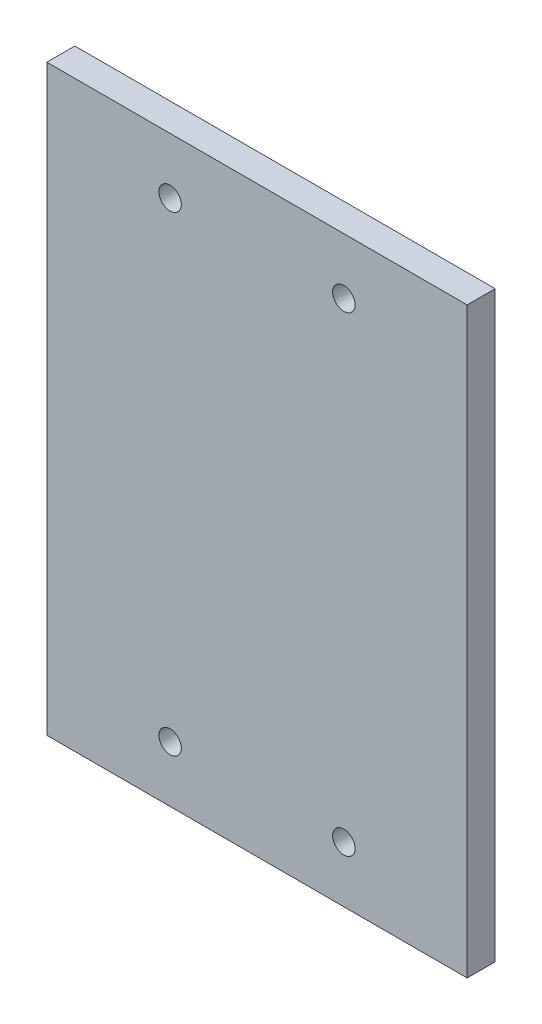
ISO-10303-21;
HEADER;
FILE_DESCRIPTION(('STEP AP214'),'2;1');
FILE_NAME('part.step','',(''),(''),'','','');
FILE_SCHEMA(('AUTOMOTIVE_DESIGN { 1 0 10303 214 1 1 1 1 }'));
ENDSEC;
DATA;
#1=APPLICATION_CONTEXT('core data for automotive mechanical design processes');
#2=APPLICATION_PROTOCOL_DEFINITION('international standard','automotive_design',2000,#1);
#3=PRODUCT_CONTEXT('',#1,'mechanical');
#4=PRODUCT('Part','Part','',(#3));
#5=PRODUCT_RELATED_PRODUCT_CATEGORY('part','',(#4));
#6=PRODUCT_DEFINITION_FORMATION('','',#4);
#7=PRODUCT_DEFINITION_CONTEXT('part definition',#1,'design');
#8=PRODUCT_DEFINITION('design','',#6,#7);
#9=PRODUCT_DEFINITION_SHAPE('','',#8);
#10=(LENGTH_UNIT() NAMED_UNIT(*) SI_UNIT(.MILLI.,.METRE.));
#11=(NAMED_UNIT(*) PLANE_ANGLE_UNIT() SI_UNIT($,.RADIAN.));
#12=(NAMED_UNIT(*) SI_UNIT($,.STERADIAN.) SOLID_ANGLE_UNIT());
#13=UNCERTAINTY_MEASURE_WITH_UNIT(LENGTH_MEASURE(1.E-05),#10,'distance_accuracy_value','');
#14=(GEOMETRIC_REPRESENTATION_CONTEXT(3) GLOBAL_UNCERTAINTY_ASSIGNED_CONTEXT((#13)) GLOBAL_UNIT_ASSIGNED_CONTEXT((#10,
#11,#12)) REPRESENTATION_CONTEXT('',''));
#15=CARTESIAN_POINT('',(0.,0.,0.));
#16=DIRECTION('',(0.,0.,1.));
#17=DIRECTION('',(1.,0.,0.));
#18=AXIS2_PLACEMENT_3D('',#15,#16,#17);
#19=CARTESIAN_POINT('',(0.,0.,5.));
#20=DIRECTION('',(0.,0.,1.));
#21=DIRECTION('',(1.,0.,0.));
#22=AXIS2_PLACEMENT_3D('',#19,#20,#21);
#23=PLANE('',#22);
#24=CARTESIAN_POINT('',(15.5,42.,5.));
#25=DIRECTION('',(0.,0.,1.));
#26=DIRECTION('',(1.,0.,0.));
#27=AXIS2_PLACEMENT_3D('',#24,#25,#26);
#28=CIRCLE('',#27,2.);
#29=CARTESIAN_POINT('',(17.5,42.,5.));
#30=VERTEX_POINT('',#29);
#31=EDGE_CURVE('E121',#30,#30,#28,.T.);
#32=ORIENTED_EDGE('',*,*,#31,.F.);
#33=EDGE_LOOP('',(#32));
#34=FACE_BOUND('',#33,.T.);
#35=CARTESIAN_POINT('',(15.5,-42.,5.));
#36=DIRECTION('',(0.,0.,1.));
#37=DIRECTION('',(1.,0.,0.));
#38=AXIS2_PLACEMENT_3D('',#35,#36,#37);
#39=CIRCLE('',#38,2.);
#40=CARTESIAN_POINT('',(17.5,-42.,5.));
#41=VERTEX_POINT('',#40);
#42=EDGE_CURVE('E100',#41,#41,#39,.T.);
#43=ORIENTED_EDGE('',*,*,#42,.F.);
#44=EDGE_LOOP('',(#43));
#45=FACE_BOUND('',#44,.T.);
#46=DIRECTION('',(1.,0.,0.));
#47=VECTOR('',#46,1.);
#48=CARTESIAN_POINT('',(-37.5,-52.,5.));
#49=LINE('',#48,#47);
#50=CARTESIAN_POINT('',(-37.5,-52.,5.));
#51=VERTEX_POINT('',#50);
#52=CARTESIAN_POINT('',(37.5,-52.,5.));
#53=VERTEX_POINT('',#52);
#54=EDGE_CURVE('E85',#51,#53,#49,.T.);
#55=ORIENTED_EDGE('',*,*,#54,.T.);
#56=DIRECTION('',(0.,1.,0.));
#57=VECTOR('',#56,1.);
#58=CARTESIAN_POINT('',(37.5,-52.,5.));
#59=LINE('',#58,#57);
#60=CARTESIAN_POINT('',(37.5,52.,5.));
#61=VERTEX_POINT('',#60);
#62=EDGE_CURVE('E80',#53,#61,#59,.T.);
#63=ORIENTED_EDGE('',*,*,#62,.T.);
#64=DIRECTION('',(-1.,0.,0.));
#65=VECTOR('',#64,1.);
#66=CARTESIAN_POINT('',(37.5,52.,5.));
#67=LINE('',#66,#65);
#68=CARTESIAN_POINT('',(-37.5,52.,5.));
#69=VERTEX_POINT('',#68);
#70=EDGE_CURVE('E83',#61,#69,#67,.T.);
#71=ORIENTED_EDGE('',*,*,#70,.T.);
#72=DIRECTION('',(0.,-1.,0.));
#73=VECTOR('',#72,1.);
#74=CARTESIAN_POINT('',(-37.5,52.,5.));
#75=LINE('',#74,#73);
#76=EDGE_CURVE('E50',#69,#51,#75,.T.);
#77=ORIENTED_EDGE('',*,*,#76,.T.);
#78=EDGE_LOOP('',(#55,#63,#71,#77));
#79=FACE_BOUND('',#78,.T.);
#80=CARTESIAN_POINT('',(-15.5,-42.,5.));
#81=DIRECTION('',(0.,0.,1.));
#82=DIRECTION('',(1.,0.,0.));
#83=AXIS2_PLACEMENT_3D('',#80,#81,#82);
#84=CIRCLE('',#83,2.);
#85=CARTESIAN_POINT('',(-13.5,-42.,5.));
#86=VERTEX_POINT('',#85);
#87=EDGE_CURVE('E115',#86,#86,#84,.T.);
#88=ORIENTED_EDGE('',*,*,#87,.F.);
#89=EDGE_LOOP('',(#88));
#90=FACE_BOUND('',#89,.T.);
#91=CARTESIAN_POINT('',(-15.5,42.,5.));
#92=DIRECTION('',(0.,0.,1.));
#93=DIRECTION('',(1.,0.,0.));
#94=AXIS2_PLACEMENT_3D('',#91,#92,#93);
#95=CIRCLE('',#94,2.);
#96=CARTESIAN_POINT('',(-13.5,42.,5.));
#97=VERTEX_POINT('',#96);
#98=EDGE_CURVE('E127',#97,#97,#95,.T.);
#99=ORIENTED_EDGE('',*,*,#98,.F.);
#100=EDGE_LOOP('',(#99));
#101=FACE_BOUND('',#100,.T.);
#102=ADVANCED_FACE('F33',(#34,#45,#79,#90,#101),#23,.T.);
#103=CARTESIAN_POINT('',(0.,0.,0.));
#104=DIRECTION('',(0.,0.,1.));
#105=DIRECTION('',(1.,0.,0.));
#106=AXIS2_PLACEMENT_3D('',#103,#104,#105);
#107=PLANE('',#106);
#108=DIRECTION('',(1.,0.,0.));
#109=VECTOR('',#108,1.);
#110=CARTESIAN_POINT('',(-37.5,-52.,0.));
#111=LINE('',#110,#109);
#112=CARTESIAN_POINT('',(-37.5,-52.,0.));
#113=VERTEX_POINT('',#112);
#114=CARTESIAN_POINT('',(37.5,-52.,0.));
#115=VERTEX_POINT('',#114);
#116=EDGE_CURVE('E97',#113,#115,#111,.T.);
#117=ORIENTED_EDGE('',*,*,#116,.F.);
#118=DIRECTION('',(0.,-1.,0.));
#119=VECTOR('',#118,1.);
#120=CARTESIAN_POINT('',(-37.5,52.,0.));
#121=LINE('',#120,#119);
#122=CARTESIAN_POINT('',(-37.5,52.,0.));
#123=VERTEX_POINT('',#122);
#124=EDGE_CURVE('E73',#123,#113,#121,.T.);
#125=ORIENTED_EDGE('',*,*,#124,.F.);
#126=DIRECTION('',(-1.,0.,0.));
#127=VECTOR('',#126,1.);
#128=CARTESIAN_POINT('',(37.5,52.,0.));
#129=LINE('',#128,#127);
#130=CARTESIAN_POINT('',(37.5,52.,0.));
#131=VERTEX_POINT('',#130);
#132=EDGE_CURVE('E67',#131,#123,#129,.T.);
#133=ORIENTED_EDGE('',*,*,#132,.F.);
#134=DIRECTION('',(0.,1.,0.));
#135=VECTOR('',#134,1.);
#136=CARTESIAN_POINT('',(37.5,-52.,0.));
#137=LINE('',#136,#135);
#138=EDGE_CURVE('E89',#115,#131,#137,.T.);
#139=ORIENTED_EDGE('',*,*,#138,.F.);
#140=EDGE_LOOP('',(#117,#125,#133,#139));
#141=FACE_BOUND('',#140,.T.);
#142=CARTESIAN_POINT('',(15.5,-42.,0.));
#143=DIRECTION('',(0.,0.,1.));
#144=DIRECTION('',(1.,0.,0.));
#145=AXIS2_PLACEMENT_3D('',#142,#143,#144);
#146=CIRCLE('',#145,2.);
#147=CARTESIAN_POINT('',(17.5,-42.,0.));
#148=VERTEX_POINT('',#147);
#149=EDGE_CURVE('E112',#148,#148,#146,.T.);
#150=ORIENTED_EDGE('',*,*,#149,.T.);
#151=EDGE_LOOP('',(#150));
#152=FACE_BOUND('',#151,.T.);
#153=CARTESIAN_POINT('',(-15.5,-42.,0.));
#154=DIRECTION('',(0.,0.,1.));
#155=DIRECTION('',(1.,0.,0.));
#156=AXIS2_PLACEMENT_3D('',#153,#154,#155);
#157=CIRCLE('',#156,2.);
#158=CARTESIAN_POINT('',(-13.5,-42.,0.));
#159=VERTEX_POINT('',#158);
#160=EDGE_CURVE('E118',#159,#159,#157,.T.);
#161=ORIENTED_EDGE('',*,*,#160,.T.);
#162=EDGE_LOOP('',(#161));
#163=FACE_BOUND('',#162,.T.);
#164=CARTESIAN_POINT('',(15.5,42.,0.));
#165=DIRECTION('',(0.,0.,1.));
#166=DIRECTION('',(1.,0.,0.));
#167=AXIS2_PLACEMENT_3D('',#164,#165,#166);
#168=CIRCLE('',#167,2.);
#169=CARTESIAN_POINT('',(17.5,42.,0.));
#170=VERTEX_POINT('',#169);
#171=EDGE_CURVE('E124',#170,#170,#168,.T.);
#172=ORIENTED_EDGE('',*,*,#171,.T.);
#173=EDGE_LOOP('',(#172));
#174=FACE_BOUND('',#173,.T.);
#175=CARTESIAN_POINT('',(-15.5,42.,0.));
#176=DIRECTION('',(0.,0.,1.));
#177=DIRECTION('',(1.,0.,0.));
#178=AXIS2_PLACEMENT_3D('',#175,#176,#177);
#179=CIRCLE('',#178,2.);
#180=CARTESIAN_POINT('',(-13.5,42.,0.));
#181=VERTEX_POINT('',#180);
#182=EDGE_CURVE('E130',#181,#181,#179,.T.);
#183=ORIENTED_EDGE('',*,*,#182,.T.);
#184=EDGE_LOOP('',(#183));
#185=FACE_BOUND('',#184,.T.);
#186=ADVANCED_FACE('F108',(#141,#152,#163,#174,#185),#107,.F.);
#187=CARTESIAN_POINT('',(-37.5,-52.,5.));
#188=DIRECTION('',(0.,1.,0.));
#189=DIRECTION('',(0.,0.,1.));
#190=AXIS2_PLACEMENT_3D('',#187,#188,#189);
#191=PLANE('',#190);
#192=ORIENTED_EDGE('',*,*,#116,.T.);
#193=DIRECTION('',(0.,0.,-1.));
#194=VECTOR('',#193,1.);
#195=CARTESIAN_POINT('',(37.5,-52.,5.));
#196=LINE('',#195,#194);
#197=EDGE_CURVE('E11',#53,#115,#196,.T.);
#198=ORIENTED_EDGE('',*,*,#197,.F.);
#199=ORIENTED_EDGE('',*,*,#54,.F.);
#200=DIRECTION('',(0.,0.,-1.));
#201=VECTOR('',#200,1.);
#202=CARTESIAN_POINT('',(-37.5,-52.,5.));
#203=LINE('',#202,#201);
#204=EDGE_CURVE('E93',#51,#113,#203,.T.);
#205=ORIENTED_EDGE('',*,*,#204,.T.);
#206=EDGE_LOOP('',(#192,#198,#199,#205));
#207=FACE_BOUND('',#206,.T.);
#208=ADVANCED_FACE('F35',(#207),#191,.F.);
#209=CARTESIAN_POINT('',(37.5,-52.,5.));
#210=DIRECTION('',(-1.,0.,0.));
#211=DIRECTION('',(0.,0.,1.));
#212=AXIS2_PLACEMENT_3D('',#209,#210,#211);
#213=PLANE('',#212);
#214=ORIENTED_EDGE('',*,*,#138,.T.);
#215=DIRECTION('',(0.,0.,-1.));
#216=VECTOR('',#215,1.);
#217=CARTESIAN_POINT('',(37.5,52.,5.));
#218=LINE('',#217,#216);
#219=EDGE_CURVE('E42',#61,#131,#218,.T.);
#220=ORIENTED_EDGE('',*,*,#219,.F.);
#221=ORIENTED_EDGE('',*,*,#62,.F.);
#222=ORIENTED_EDGE('',*,*,#197,.T.);
#223=EDGE_LOOP('',(#214,#220,#221,#222));
#224=FACE_BOUND('',#223,.T.);
#225=ADVANCED_FACE('F88',(#224),#213,.F.);
#226=CARTESIAN_POINT('',(37.5,52.,5.));
#227=DIRECTION('',(0.,-1.,0.));
#228=DIRECTION('',(0.,0.,-1.));
#229=AXIS2_PLACEMENT_3D('',#226,#227,#228);
#230=PLANE('',#229);
#231=ORIENTED_EDGE('',*,*,#132,.T.);
#232=DIRECTION('',(0.,0.,-1.));
#233=VECTOR('',#232,1.);
#234=CARTESIAN_POINT('',(-37.5,52.,5.));
#235=LINE('',#234,#233);
#236=EDGE_CURVE('E90',#69,#123,#235,.T.);
#237=ORIENTED_EDGE('',*,*,#236,.F.);
#238=ORIENTED_EDGE('',*,*,#70,.F.);
#239=ORIENTED_EDGE('',*,*,#219,.T.);
#240=EDGE_LOOP('',(#231,#237,#238,#239));
#241=FACE_BOUND('',#240,.T.);
#242=ADVANCED_FACE('F91',(#241),#230,.F.);
#243=CARTESIAN_POINT('',(-37.5,52.,5.));
#244=DIRECTION('',(1.,0.,0.));
#245=DIRECTION('',(0.,0.,-1.));
#246=AXIS2_PLACEMENT_3D('',#243,#244,#245);
#247=PLANE('',#246);
#248=ORIENTED_EDGE('',*,*,#124,.T.);
#249=ORIENTED_EDGE('',*,*,#204,.F.);
#250=ORIENTED_EDGE('',*,*,#76,.F.);
#251=ORIENTED_EDGE('',*,*,#236,.T.);
#252=EDGE_LOOP('',(#248,#249,#250,#251));
#253=FACE_BOUND('',#252,.T.);
#254=ADVANCED_FACE('F105',(#253),#247,.F.);
#255=CARTESIAN_POINT('',(15.5,-42.,5.));
#256=DIRECTION('',(0.,0.,-1.));
#257=DIRECTION('',(-1.,0.,0.));
#258=AXIS2_PLACEMENT_3D('',#255,#256,#257);
#259=CYLINDRICAL_SURFACE('',#258,2.);
#260=ORIENTED_EDGE('',*,*,#42,.T.);
#261=EDGE_LOOP('',(#260));
#262=FACE_BOUND('',#261,.T.);
#263=ORIENTED_EDGE('',*,*,#149,.F.);
#264=EDGE_LOOP('',(#263));
#265=FACE_BOUND('',#264,.T.);
#266=ADVANCED_FACE('F149',(#262,#265),#259,.F.);
#267=CARTESIAN_POINT('',(-15.5,-42.,5.));
#268=DIRECTION('',(0.,0.,-1.));
#269=DIRECTION('',(-1.,0.,0.));
#270=AXIS2_PLACEMENT_3D('',#267,#268,#269);
#271=CYLINDRICAL_SURFACE('',#270,2.);
#272=ORIENTED_EDGE('',*,*,#87,.T.);
#273=EDGE_LOOP('',(#272));
#274=FACE_BOUND('',#273,.T.);
#275=ORIENTED_EDGE('',*,*,#160,.F.);
#276=EDGE_LOOP('',(#275));
#277=FACE_BOUND('',#276,.T.);
#278=ADVANCED_FACE('F195',(#274,#277),#271,.F.);
#279=CARTESIAN_POINT('',(15.5,42.,5.));
#280=DIRECTION('',(0.,0.,-1.));
#281=DIRECTION('',(-1.,0.,0.));
#282=AXIS2_PLACEMENT_3D('',#279,#280,#281);
#283=CYLINDRICAL_SURFACE('',#282,2.);
#284=ORIENTED_EDGE('',*,*,#31,.T.);
#285=EDGE_LOOP('',(#284));
#286=FACE_BOUND('',#285,.T.);
#287=ORIENTED_EDGE('',*,*,#171,.F.);
#288=EDGE_LOOP('',(#287));
#289=FACE_BOUND('',#288,.T.);
#290=ADVANCED_FACE('F203',(#286,#289),#283,.F.);
#291=CARTESIAN_POINT('',(-15.5,42.,5.));
#292=DIRECTION('',(0.,0.,-1.));
#293=DIRECTION('',(-1.,0.,0.));
#294=AXIS2_PLACEMENT_3D('',#291,#292,#293);
#295=CYLINDRICAL_SURFACE('',#294,2.);
#296=ORIENTED_EDGE('',*,*,#98,.T.);
#297=EDGE_LOOP('',(#296));
#298=FACE_BOUND('',#297,.T.);
#299=ORIENTED_EDGE('',*,*,#182,.F.);
#300=EDGE_LOOP('',(#299));
#301=FACE_BOUND('',#300,.T.);
#302=ADVANCED_FACE('F136',(#298,#301),#295,.F.);
#303=CLOSED_SHELL('',(#102,#186,#208,#225,#242,#254,#266,#278,#290,#302));
#304=MANIFOLD_SOLID_BREP('B2',#303);
#305=ADVANCED_BREP_SHAPE_REPRESENTATION('',(#18,#304),#14);
#306=SHAPE_DEFINITION_REPRESENTATION(#9,#305);
ENDSEC;
END-ISO-10303-21;
